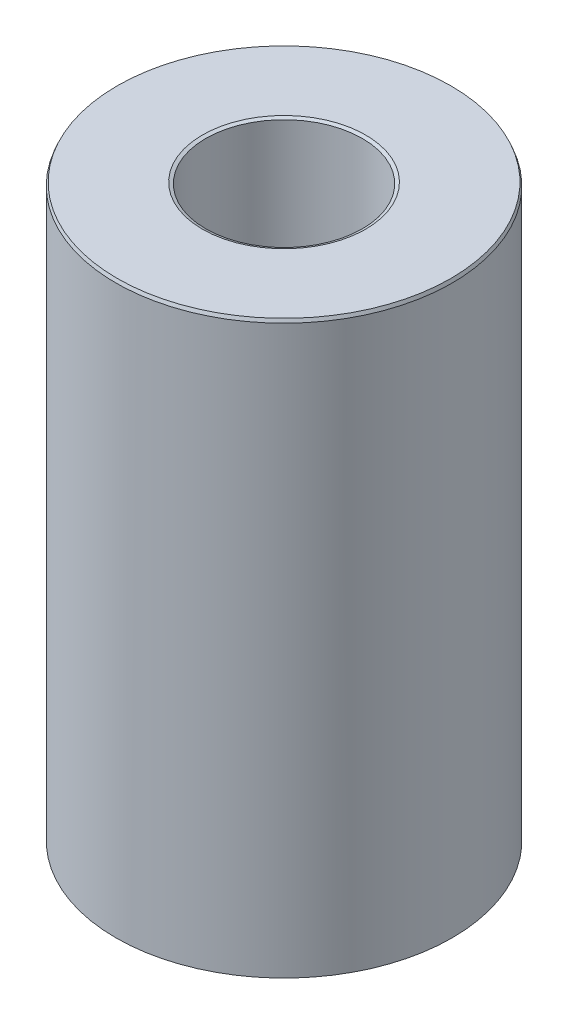
ISO-10303-21;
HEADER;
FILE_DESCRIPTION(('STEP AP214'),'2;1');
FILE_NAME('part.step','',(''),(''),'','','');
FILE_SCHEMA(('AUTOMOTIVE_DESIGN { 1 0 10303 214 1 1 1 1 }'));
ENDSEC;
DATA;
#1=APPLICATION_CONTEXT('core data for automotive mechanical design processes');
#2=APPLICATION_PROTOCOL_DEFINITION('international standard','automotive_design',2000,#1);
#3=PRODUCT_CONTEXT('',#1,'mechanical');
#4=PRODUCT('Part','Part','',(#3));
#5=PRODUCT_RELATED_PRODUCT_CATEGORY('part','',(#4));
#6=PRODUCT_DEFINITION_FORMATION('','',#4);
#7=PRODUCT_DEFINITION_CONTEXT('part definition',#1,'design');
#8=PRODUCT_DEFINITION('design','',#6,#7);
#9=PRODUCT_DEFINITION_SHAPE('','',#8);
#10=(LENGTH_UNIT() NAMED_UNIT(*) SI_UNIT(.MILLI.,.METRE.));
#11=(NAMED_UNIT(*) PLANE_ANGLE_UNIT() SI_UNIT($,.RADIAN.));
#12=(NAMED_UNIT(*) SI_UNIT($,.STERADIAN.) SOLID_ANGLE_UNIT());
#13=UNCERTAINTY_MEASURE_WITH_UNIT(LENGTH_MEASURE(1.E-05),#10,'distance_accuracy_value','');
#14=(GEOMETRIC_REPRESENTATION_CONTEXT(3) GLOBAL_UNCERTAINTY_ASSIGNED_CONTEXT((#13)) GLOBAL_UNIT_ASSIGNED_CONTEXT((#10,
#11,#12)) REPRESENTATION_CONTEXT('',''));
#15=CARTESIAN_POINT('',(0.,0.,0.));
#16=DIRECTION('',(0.,0.,1.));
#17=DIRECTION('',(1.,0.,0.));
#18=AXIS2_PLACEMENT_3D('',#15,#16,#17);
#19=CARTESIAN_POINT('',(0.,187.021288903411,0.));
#20=DIRECTION('',(0.,-1.,0.));
#21=DIRECTION('',(0.,0.,-1.));
#22=AXIS2_PLACEMENT_3D('',#19,#20,#21);
#23=CYLINDRICAL_SURFACE('',#22,55.);
#24=CARTESIAN_POINT('',(0.,0.429422029330523,0.));
#25=DIRECTION('',(0.,1.,0.));
#26=DIRECTION('',(0.,0.,1.));
#27=AXIS2_PLACEMENT_3D('',#24,#25,#26);
#28=CIRCLE('',#27,55.);
#29=CARTESIAN_POINT('',(0.,0.429422029330495,-55.));
#30=VERTEX_POINT('',#29);
#31=EDGE_CURVE('E10',#30,#30,#28,.T.);
#32=CARTESIAN_POINT('',(0.,185.933866372463,0.));
#33=DIRECTION('',(0.,1.,0.));
#34=DIRECTION('',(0.,0.,1.));
#35=AXIS2_PLACEMENT_3D('',#32,#33,#34);
#36=CIRCLE('',#35,55.);
#37=CARTESIAN_POINT('',(0.,185.933866372463,-55.));
#38=VERTEX_POINT('',#37);
#39=EDGE_CURVE('E50',#38,#38,#36,.F.);
#40=CARTESIAN_POINT('',(0.,0.429422029330495,-55.));
#41=CARTESIAN_POINT('',(0.,2.36175999123813,-55.));
#42=CARTESIAN_POINT('',(0.,4.29409795314576,-55.));
#43=CARTESIAN_POINT('',(0.,8.15877387696102,-55.));
#44=CARTESIAN_POINT('',(0.,10.0911118388686,-55.));
#45=CARTESIAN_POINT('',(0.,13.9557877626839,-55.));
#46=CARTESIAN_POINT('',(0.,15.8881257245915,-55.));
#47=CARTESIAN_POINT('',(0.,19.7528016484068,-55.));
#48=CARTESIAN_POINT('',(0.,21.6851396103144,-55.));
#49=CARTESIAN_POINT('',(0.,25.5498155341297,-55.));
#50=CARTESIAN_POINT('',(0.,27.4821534960373,-55.));
#51=CARTESIAN_POINT('',(0.,31.3468294198526,-55.));
#52=CARTESIAN_POINT('',(0.,33.2791673817602,-55.));
#53=CARTESIAN_POINT('',(0.,37.1438433055755,-55.));
#54=CARTESIAN_POINT('',(0.,39.0761812674831,-55.));
#55=CARTESIAN_POINT('',(0.,42.9408571912984,-55.));
#56=CARTESIAN_POINT('',(0.,44.873195153206,-55.));
#57=CARTESIAN_POINT('',(0.,48.7378710770213,-55.));
#58=CARTESIAN_POINT('',(0.,50.6702090389289,-55.));
#59=CARTESIAN_POINT('',(0.,54.5348849627442,-55.));
#60=CARTESIAN_POINT('',(0.,56.4672229246518,-55.));
#61=CARTESIAN_POINT('',(0.,60.331898848467,-55.));
#62=CARTESIAN_POINT('',(0.,62.2642368103747,-55.));
#63=CARTESIAN_POINT('',(0.,66.1289127341899,-55.));
#64=CARTESIAN_POINT('',(0.,68.0612506960976,-55.));
#65=CARTESIAN_POINT('',(0.,71.9259266199128,-55.));
#66=CARTESIAN_POINT('',(0.,73.8582645818205,-55.));
#67=CARTESIAN_POINT('',(0.,77.7229405056357,-55.));
#68=CARTESIAN_POINT('',(0.,79.6552784675434,-55.));
#69=CARTESIAN_POINT('',(0.,83.5199543913586,-55.));
#70=CARTESIAN_POINT('',(0.,85.4522923532662,-55.));
#71=CARTESIAN_POINT('',(0.,89.3169682770815,-55.));
#72=CARTESIAN_POINT('',(0.,91.2493062389891,-55.));
#73=CARTESIAN_POINT('',(0.,95.1139821628044,-55.));
#74=CARTESIAN_POINT('',(0.,97.046320124712,-55.));
#75=CARTESIAN_POINT('',(0.,100.910996048527,-55.));
#76=CARTESIAN_POINT('',(0.,102.843334010435,-55.));
#77=CARTESIAN_POINT('',(0.,106.70800993425,-55.));
#78=CARTESIAN_POINT('',(0.,108.640347896158,-55.));
#79=CARTESIAN_POINT('',(0.,112.505023819973,-55.));
#80=CARTESIAN_POINT('',(0.,114.437361781881,-55.));
#81=CARTESIAN_POINT('',(0.,118.302037705696,-55.));
#82=CARTESIAN_POINT('',(0.,120.234375667604,-55.));
#83=CARTESIAN_POINT('',(0.,124.099051591419,-55.));
#84=CARTESIAN_POINT('',(0.,126.031389553326,-55.));
#85=CARTESIAN_POINT('',(0.,129.896065477142,-55.));
#86=CARTESIAN_POINT('',(0.,131.828403439049,-55.));
#87=CARTESIAN_POINT('',(0.,135.693079362865,-55.));
#88=CARTESIAN_POINT('',(0.,137.625417324772,-55.));
#89=CARTESIAN_POINT('',(0.,141.490093248588,-55.));
#90=CARTESIAN_POINT('',(0.,143.422431210495,-55.));
#91=CARTESIAN_POINT('',(0.,147.28710713431,-55.));
#92=CARTESIAN_POINT('',(0.,149.219445096218,-55.));
#93=CARTESIAN_POINT('',(0.,153.084121020033,-55.));
#94=CARTESIAN_POINT('',(0.,155.016458981941,-55.));
#95=CARTESIAN_POINT('',(0.,158.881134905756,-55.));
#96=CARTESIAN_POINT('',(0.,160.813472867664,-55.));
#97=CARTESIAN_POINT('',(0.,164.678148791479,-55.));
#98=CARTESIAN_POINT('',(0.,166.610486753387,-55.));
#99=CARTESIAN_POINT('',(0.,170.475162677202,-55.));
#100=CARTESIAN_POINT('',(0.,172.40750063911,-55.));
#101=CARTESIAN_POINT('',(0.,176.272176562925,-55.));
#102=CARTESIAN_POINT('',(0.,178.204514524833,-55.));
#103=CARTESIAN_POINT('',(0.,182.069190448648,-55.));
#104=CARTESIAN_POINT('',(0.,184.001528410555,-55.));
#105=CARTESIAN_POINT('',(0.,185.933866372463,-55.));
#106=B_SPLINE_CURVE_WITH_KNOTS('',3,(#40,#41,#42,#43,#44,#45,#46,#47,#48,#49,#50,#51,#52,#53,
#54,#55,#56,#57,#58,#59,#60,#61,#62,#63,#64,#65,#66,#67,#68,#69,#70,#71,#72,#73,#74,#75,#76,#77,
#78,#79,#80,#81,#82,#83,#84,#85,#86,#87,#88,#89,#90,#91,#92,#93,#94,#95,#96,#97,#98,#99,#100,
#101,#102,#103,#104,#105),.UNSPECIFIED.,.F.,.F.,(4,2,2,2,2,2,2,2,2,2,2,2,2,2,2,2,2,2,2,2,2,2,2,
2,2,2,2,2,2,2,2,2,4),(0.,5.7970138857229,11.5940277714458,17.3910416571687,23.1880555428916,
28.9850694286145,34.7820833143374,40.5790972000603,46.3761110857832,52.173124971506,
57.9701388572289,63.7671527429518,69.5641666286747,75.3611805143976,81.1581944001205,
86.9552082858434,92.7522221715663,98.5492360572892,104.346249943012,110.143263828735,
115.940277714458,121.737291600181,127.534305485904,133.331319371627,139.128333257349,
144.925347143072,150.722361028795,156.519374914518,162.316388800241,168.113402685964,
173.910416571687,179.70743045741,185.504444343133),.UNSPECIFIED.);
#107=EDGE_CURVE('BSEAM39',#30,#38,#106,.T.);
#108=ORIENTED_EDGE('',*,*,#31,.T.);
#109=ORIENTED_EDGE('',*,*,#39,.T.);
#110=ORIENTED_EDGE('',*,*,#107,.T.);
#111=ORIENTED_EDGE('',*,*,#107,.F.);
#112=EDGE_LOOP('',(#108,#110,#109,#111));
#113=FACE_BOUND('',#112,.T.);
#114=ADVANCED_FACE('F39',(#113),#23,.T.);
#115=CARTESIAN_POINT('',(0.,187.021288903411,0.));
#116=DIRECTION('',(0.,1.,0.));
#117=DIRECTION('',(0.,0.,1.));
#118=AXIS2_PLACEMENT_3D('',#115,#116,#117);
#119=PLANE('',#118);
#120=CARTESIAN_POINT('',(0.,187.021288903411,0.));
#121=DIRECTION('',(0.,1.,0.));
#122=DIRECTION('',(0.,0.,1.));
#123=AXIS2_PLACEMENT_3D('',#120,#121,#122);
#124=CIRCLE('',#123,26.6987405233162);
#125=CARTESIAN_POINT('',(0.,187.021288903411,26.6987405233162));
#126=VERTEX_POINT('',#125);
#127=EDGE_CURVE('E58',#126,#126,#124,.F.);
#128=ORIENTED_EDGE('',*,*,#127,.T.);
#129=EDGE_LOOP('',(#128));
#130=FACE_BOUND('',#129,.T.);
#131=CARTESIAN_POINT('',(0.,187.021288903411,0.));
#132=DIRECTION('',(0.,1.,0.));
#133=DIRECTION('',(0.,0.,1.));
#134=AXIS2_PLACEMENT_3D('',#131,#132,#133);
#135=CIRCLE('',#134,54.5705779706698);
#136=CARTESIAN_POINT('',(0.,187.021288903411,54.5705779706698));
#137=VERTEX_POINT('',#136);
#138=EDGE_CURVE('E61',#137,#137,#135,.T.);
#139=ORIENTED_EDGE('',*,*,#138,.T.);
#140=EDGE_LOOP('',(#139));
#141=FACE_BOUND('',#140,.T.);
#142=ADVANCED_FACE('F88',(#130,#141),#119,.T.);
#143=CARTESIAN_POINT('',(0.,0.,0.));
#144=DIRECTION('',(0.,1.,0.));
#145=DIRECTION('',(0.,0.,1.));
#146=AXIS2_PLACEMENT_3D('',#143,#144,#145);
#147=PLANE('',#146);
#148=CARTESIAN_POINT('',(0.,0.,0.));
#149=DIRECTION('',(0.,1.,0.));
#150=DIRECTION('',(0.,0.,1.));
#151=AXIS2_PLACEMENT_3D('',#148,#149,#150);
#152=CIRCLE('',#151,26.0407400216978);
#153=CARTESIAN_POINT('',(0.,0.,26.0407400216978));
#154=VERTEX_POINT('',#153);
#155=EDGE_CURVE('E51',#154,#154,#152,.T.);
#156=ORIENTED_EDGE('',*,*,#155,.T.);
#157=EDGE_LOOP('',(#156));
#158=FACE_BOUND('',#157,.T.);
#159=CARTESIAN_POINT('',(0.,0.,0.));
#160=DIRECTION('',(0.,1.,0.));
#161=DIRECTION('',(0.,0.,1.));
#162=AXIS2_PLACEMENT_3D('',#159,#160,#161);
#163=CIRCLE('',#162,53.912577469051);
#164=CARTESIAN_POINT('',(0.,0.,53.912577469051));
#165=VERTEX_POINT('',#164);
#166=EDGE_CURVE('E54',#165,#165,#163,.F.);
#167=ORIENTED_EDGE('',*,*,#166,.T.);
#168=EDGE_LOOP('',(#167));
#169=FACE_BOUND('',#168,.T.);
#170=ADVANCED_FACE('F83',(#158,#169),#147,.F.);
#171=CARTESIAN_POINT('',(0.,187.021288903411,0.));
#172=DIRECTION('',(0.,-1.,0.));
#173=DIRECTION('',(0.,0.,-1.));
#174=AXIS2_PLACEMENT_3D('',#171,#172,#173);
#175=CYLINDRICAL_SURFACE('',#174,25.6113179923673);
#176=CARTESIAN_POINT('',(0.,186.591866874081,0.));
#177=DIRECTION('',(0.,1.,0.));
#178=DIRECTION('',(0.,0.,1.));
#179=AXIS2_PLACEMENT_3D('',#176,#177,#178);
#180=CIRCLE('',#179,25.6113179923673);
#181=CARTESIAN_POINT('',(0.,186.591866874081,-25.6113179923673));
#182=VERTEX_POINT('',#181);
#183=EDGE_CURVE('E67',#182,#182,#180,.T.);
#184=CARTESIAN_POINT('',(0.,1.08742253094876,0.));
#185=DIRECTION('',(0.,1.,0.));
#186=DIRECTION('',(0.,0.,1.));
#187=AXIS2_PLACEMENT_3D('',#184,#185,#186);
#188=CIRCLE('',#187,25.6113179923673);
#189=CARTESIAN_POINT('',(0.,1.08742253094873,-25.6113179923673));
#190=VERTEX_POINT('',#189);
#191=EDGE_CURVE('E69',#190,#190,#188,.F.);
#192=CARTESIAN_POINT('',(0.,186.591866874081,-25.6113179923673));
#193=CARTESIAN_POINT('',(0.,184.659528912173,-25.6113179923673));
#194=CARTESIAN_POINT('',(0.,182.727190950266,-25.6113179923673));
#195=CARTESIAN_POINT('',(0.,178.86251502645,-25.6113179923673));
#196=CARTESIAN_POINT('',(0.,176.930177064543,-25.6113179923673));
#197=CARTESIAN_POINT('',(0.,173.065501140727,-25.6113179923673));
#198=CARTESIAN_POINT('',(0.,171.13316317882,-25.6113179923673));
#199=CARTESIAN_POINT('',(0.,167.268487255005,-25.6113179923673));
#200=CARTESIAN_POINT('',(0.,165.336149293097,-25.6113179923673));
#201=CARTESIAN_POINT('',(0.,161.471473369282,-25.6113179923673));
#202=CARTESIAN_POINT('',(0.,159.539135407374,-25.6113179923673));
#203=CARTESIAN_POINT('',(0.,155.674459483559,-25.6113179923673));
#204=CARTESIAN_POINT('',(0.,153.742121521651,-25.6113179923673));
#205=CARTESIAN_POINT('',(0.,149.877445597836,-25.6113179923673));
#206=CARTESIAN_POINT('',(0.,147.945107635928,-25.6113179923673));
#207=CARTESIAN_POINT('',(0.,144.080431712113,-25.6113179923673));
#208=CARTESIAN_POINT('',(0.,142.148093750205,-25.6113179923673));
#209=CARTESIAN_POINT('',(0.,138.28341782639,-25.6113179923673));
#210=CARTESIAN_POINT('',(0.,136.351079864483,-25.6113179923673));
#211=CARTESIAN_POINT('',(0.,132.486403940667,-25.6113179923673));
#212=CARTESIAN_POINT('',(0.,130.55406597876,-25.6113179923673));
#213=CARTESIAN_POINT('',(0.,126.689390054944,-25.6113179923673));
#214=CARTESIAN_POINT('',(0.,124.757052093037,-25.6113179923673));
#215=CARTESIAN_POINT('',(0.,120.892376169222,-25.6113179923673));
#216=CARTESIAN_POINT('',(0.,118.960038207314,-25.6113179923673));
#217=CARTESIAN_POINT('',(0.,115.095362283499,-25.6113179923673));
#218=CARTESIAN_POINT('',(0.,113.163024321591,-25.6113179923673));
#219=CARTESIAN_POINT('',(0.,109.298348397776,-25.6113179923673));
#220=CARTESIAN_POINT('',(0.,107.366010435868,-25.6113179923673));
#221=CARTESIAN_POINT('',(0.,103.501334512053,-25.6113179923673));
#222=CARTESIAN_POINT('',(0.,101.568996550145,-25.6113179923673));
#223=CARTESIAN_POINT('',(0.,97.70432062633,-25.6113179923673));
#224=CARTESIAN_POINT('',(0.,95.7719826644224,-25.6113179923673));
#225=CARTESIAN_POINT('',(0.,91.9073067406071,-25.6113179923673));
#226=CARTESIAN_POINT('',(0.,89.9749687786995,-25.6113179923673));
#227=CARTESIAN_POINT('',(0.,86.1102928548843,-25.6113179923673));
#228=CARTESIAN_POINT('',(0.,84.1779548929766,-25.6113179923673));
#229=CARTESIAN_POINT('',(0.,80.3132789691614,-25.6113179923673));
#230=CARTESIAN_POINT('',(0.,78.3809410072538,-25.6113179923673));
#231=CARTESIAN_POINT('',(0.,74.5162650834385,-25.6113179923673));
#232=CARTESIAN_POINT('',(0.,72.5839271215309,-25.6113179923673));
#233=CARTESIAN_POINT('',(0.,68.7192511977156,-25.6113179923673));
#234=CARTESIAN_POINT('',(0.,66.786913235808,-25.6113179923673));
#235=CARTESIAN_POINT('',(0.,62.9222373119928,-25.6113179923673));
#236=CARTESIAN_POINT('',(0.,60.9898993500851,-25.6113179923673));
#237=CARTESIAN_POINT('',(0.,57.1252234262699,-25.6113179923673));
#238=CARTESIAN_POINT('',(0.,55.1928854643623,-25.6113179923673));
#239=CARTESIAN_POINT('',(0.,51.328209540547,-25.6113179923673));
#240=CARTESIAN_POINT('',(0.,49.3958715786394,-25.6113179923673));
#241=CARTESIAN_POINT('',(0.,45.5311956548241,-25.6113179923673));
#242=CARTESIAN_POINT('',(0.,43.5988576929165,-25.6113179923673));
#243=CARTESIAN_POINT('',(0.,39.7341817691012,-25.6113179923673));
#244=CARTESIAN_POINT('',(0.,37.8018438071936,-25.6113179923673));
#245=CARTESIAN_POINT('',(0.,33.9371678833784,-25.6113179923673));
#246=CARTESIAN_POINT('',(0.,32.0048299214707,-25.6113179923673));
#247=CARTESIAN_POINT('',(0.,28.1401539976555,-25.6113179923673));
#248=CARTESIAN_POINT('',(0.,26.2078160357479,-25.6113179923673));
#249=CARTESIAN_POINT('',(0.,22.3431401119326,-25.6113179923673));
#250=CARTESIAN_POINT('',(0.,20.410802150025,-25.6113179923673));
#251=CARTESIAN_POINT('',(0.,16.5461262262098,-25.6113179923673));
#252=CARTESIAN_POINT('',(0.,14.6137882643021,-25.6113179923673));
#253=CARTESIAN_POINT('',(0.,10.7491123404868,-25.6113179923673));
#254=CARTESIAN_POINT('',(0.,8.81677437857921,-25.6113179923673));
#255=CARTESIAN_POINT('',(0.,4.95209845476396,-25.6113179923673));
#256=CARTESIAN_POINT('',(0.,3.01976049285635,-25.6113179923673));
#257=CARTESIAN_POINT('',(0.,1.08742253094873,-25.6113179923673));
#258=B_SPLINE_CURVE_WITH_KNOTS('',3,(#192,#193,#194,#195,#196,#197,#198,#199,#200,#201,#202,
#203,#204,#205,#206,#207,#208,#209,#210,#211,#212,#213,#214,#215,#216,#217,#218,#219,#220,#221,
#222,#223,#224,#225,#226,#227,#228,#229,#230,#231,#232,#233,#234,#235,#236,#237,#238,#239,#240,
#241,#242,#243,#244,#245,#246,#247,#248,#249,#250,#251,#252,#253,#254,#255,#256,#257),
.UNSPECIFIED.,.F.,.F.,(4,2,2,2,2,2,2,2,2,2,2,2,2,2,2,2,2,2,2,2,2,2,2,2,2,2,2,2,2,2,2,2,4),(0.,
5.7970138857229,11.5940277714458,17.3910416571686,23.1880555428915,28.9850694286144,
34.7820833143373,40.5790972000602,46.376111085783,52.1731249715059,57.9701388572288,
63.7671527429517,69.5641666286745,75.3611805143974,81.1581944001203,86.9552082858432,
92.7522221715661,98.5492360572889,104.346249943012,110.143263828735,115.940277714458,
121.73729160018,127.534305485903,133.331319371626,139.128333257349,144.925347143072,
150.722361028795,156.519374914518,162.316388800241,168.113402685963,173.910416571686,
179.707430457409,185.504444343132),.UNSPECIFIED.);
#259=EDGE_CURVE('BSEAM71',#182,#190,#258,.T.);
#260=ORIENTED_EDGE('',*,*,#183,.T.);
#261=ORIENTED_EDGE('',*,*,#191,.T.);
#262=ORIENTED_EDGE('',*,*,#259,.T.);
#263=ORIENTED_EDGE('',*,*,#259,.F.);
#264=EDGE_LOOP('',(#260,#262,#261,#263));
#265=FACE_BOUND('',#264,.T.);
#266=ADVANCED_FACE('F71',(#265),#175,.F.);
#267=CARTESIAN_POINT('',(0.,186.591866874081,0.));
#268=DIRECTION('',(0.,1.,0.));
#269=DIRECTION('',(0.,0.,1.));
#270=AXIS2_PLACEMENT_3D('',#267,#268,#269);
#271=CONICAL_SURFACE('',#270,25.6113179923673,1.19469511590339);
#272=ORIENTED_EDGE('',*,*,#127,.F.);
#273=EDGE_LOOP('',(#272));
#274=FACE_BOUND('',#273,.T.);
#275=ORIENTED_EDGE('',*,*,#183,.F.);
#276=EDGE_LOOP('',(#275));
#277=FACE_BOUND('',#276,.T.);
#278=ADVANCED_FACE('F77',(#274,#277),#271,.F.);
#279=CARTESIAN_POINT('',(0.,0.,0.));
#280=DIRECTION('',(0.,-1.,0.));
#281=DIRECTION('',(0.,0.,-1.));
#282=AXIS2_PLACEMENT_3D('',#279,#280,#281);
#283=CONICAL_SURFACE('',#282,26.0407400216978,0.376101210891493);
#284=ORIENTED_EDGE('',*,*,#191,.F.);
#285=EDGE_LOOP('',(#284));
#286=FACE_BOUND('',#285,.T.);
#287=ORIENTED_EDGE('',*,*,#155,.F.);
#288=EDGE_LOOP('',(#287));
#289=FACE_BOUND('',#288,.T.);
#290=ADVANCED_FACE('F73',(#286,#289),#283,.F.);
#291=CARTESIAN_POINT('',(0.,0.429422029330523,0.));
#292=DIRECTION('',(0.,1.,0.));
#293=DIRECTION('',(0.,0.,1.));
#294=AXIS2_PLACEMENT_3D('',#291,#292,#293);
#295=CONICAL_SURFACE('',#294,55.,1.1946951159034);
#296=ORIENTED_EDGE('',*,*,#166,.F.);
#297=EDGE_LOOP('',(#296));
#298=FACE_BOUND('',#297,.T.);
#299=ORIENTED_EDGE('',*,*,#31,.F.);
#300=EDGE_LOOP('',(#299));
#301=FACE_BOUND('',#300,.T.);
#302=ADVANCED_FACE('F76',(#298,#301),#295,.T.);
#303=CARTESIAN_POINT('',(0.,187.021288903411,0.));
#304=DIRECTION('',(0.,-1.,0.));
#305=DIRECTION('',(0.,0.,-1.));
#306=AXIS2_PLACEMENT_3D('',#303,#304,#305);
#307=CONICAL_SURFACE('',#306,54.5705779706698,0.376101210891492);
#308=ORIENTED_EDGE('',*,*,#39,.F.);
#309=EDGE_LOOP('',(#308));
#310=FACE_BOUND('',#309,.T.);
#311=ORIENTED_EDGE('',*,*,#138,.F.);
#312=EDGE_LOOP('',(#311));
#313=FACE_BOUND('',#312,.T.);
#314=ADVANCED_FACE('F45',(#310,#313),#307,.T.);
#315=CLOSED_SHELL('',(#114,#142,#170,#266,#278,#290,#302,#314));
#316=MANIFOLD_SOLID_BREP('B2',#315);
#317=ADVANCED_BREP_SHAPE_REPRESENTATION('',(#18,#316),#14);
#318=SHAPE_DEFINITION_REPRESENTATION(#9,#317);
ENDSEC;
END-ISO-10303-21;
